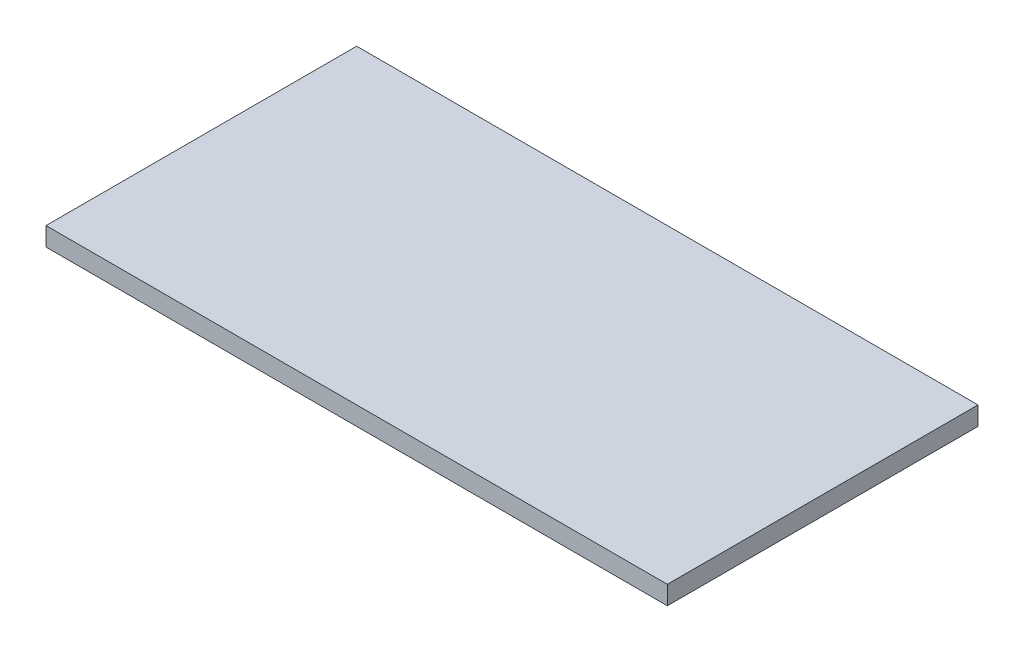
ISO-10303-21;
HEADER;
FILE_DESCRIPTION(('STEP AP214'),'2;1');
FILE_NAME('part.step','',(''),(''),'','','');
FILE_SCHEMA(('AUTOMOTIVE_DESIGN { 1 0 10303 214 1 1 1 1 }'));
ENDSEC;
DATA;
#1=APPLICATION_CONTEXT('core data for automotive mechanical design processes');
#2=APPLICATION_PROTOCOL_DEFINITION('international standard','automotive_design',2000,#1);
#3=PRODUCT_CONTEXT('',#1,'mechanical');
#4=PRODUCT('Part','Part','',(#3));
#5=PRODUCT_RELATED_PRODUCT_CATEGORY('part','',(#4));
#6=PRODUCT_DEFINITION_FORMATION('','',#4);
#7=PRODUCT_DEFINITION_CONTEXT('part definition',#1,'design');
#8=PRODUCT_DEFINITION('design','',#6,#7);
#9=PRODUCT_DEFINITION_SHAPE('','',#8);
#10=(LENGTH_UNIT() NAMED_UNIT(*) SI_UNIT(.MILLI.,.METRE.));
#11=(NAMED_UNIT(*) PLANE_ANGLE_UNIT() SI_UNIT($,.RADIAN.));
#12=(NAMED_UNIT(*) SI_UNIT($,.STERADIAN.) SOLID_ANGLE_UNIT());
#13=UNCERTAINTY_MEASURE_WITH_UNIT(LENGTH_MEASURE(1.E-05),#10,'distance_accuracy_value','');
#14=(GEOMETRIC_REPRESENTATION_CONTEXT(3) GLOBAL_UNCERTAINTY_ASSIGNED_CONTEXT((#13)) GLOBAL_UNIT_ASSIGNED_CONTEXT((#10,
#11,#12)) REPRESENTATION_CONTEXT('',''));
#15=CARTESIAN_POINT('',(0.,0.,0.));
#16=DIRECTION('',(0.,0.,1.));
#17=DIRECTION('',(1.,0.,0.));
#18=AXIS2_PLACEMENT_3D('',#15,#16,#17);
#19=CARTESIAN_POINT('',(12.7,0.762,6.35));
#20=DIRECTION('',(-1.,0.,0.));
#21=DIRECTION('',(0.,0.,1.));
#22=AXIS2_PLACEMENT_3D('',#19,#20,#21);
#23=PLANE('',#22);
#24=DIRECTION('',(0.,0.,-1.));
#25=VECTOR('',#24,1.);
#26=CARTESIAN_POINT('',(12.7,0.,6.35));
#27=LINE('',#26,#25);
#28=CARTESIAN_POINT('',(12.7,0.,6.35));
#29=VERTEX_POINT('',#28);
#30=CARTESIAN_POINT('',(12.7,0.,-6.35));
#31=VERTEX_POINT('',#30);
#32=EDGE_CURVE('E102',#29,#31,#27,.T.);
#33=ORIENTED_EDGE('',*,*,#32,.T.);
#34=DIRECTION('',(0.,-1.,0.));
#35=VECTOR('',#34,1.);
#36=CARTESIAN_POINT('',(12.7,0.762,-6.35));
#37=LINE('',#36,#35);
#38=CARTESIAN_POINT('',(12.7,0.762,-6.35));
#39=VERTEX_POINT('',#38);
#40=EDGE_CURVE('E11',#39,#31,#37,.T.);
#41=ORIENTED_EDGE('',*,*,#40,.F.);
#42=DIRECTION('',(0.,0.,-1.));
#43=VECTOR('',#42,1.);
#44=CARTESIAN_POINT('',(12.7,0.762,6.35));
#45=LINE('',#44,#43);
#46=CARTESIAN_POINT('',(12.7,0.762,6.35));
#47=VERTEX_POINT('',#46);
#48=EDGE_CURVE('E90',#47,#39,#45,.T.);
#49=ORIENTED_EDGE('',*,*,#48,.F.);
#50=DIRECTION('',(0.,-1.,0.));
#51=VECTOR('',#50,1.);
#52=CARTESIAN_POINT('',(12.7,0.762,6.35));
#53=LINE('',#52,#51);
#54=EDGE_CURVE('E98',#47,#29,#53,.T.);
#55=ORIENTED_EDGE('',*,*,#54,.T.);
#56=EDGE_LOOP('',(#33,#41,#49,#55));
#57=FACE_BOUND('',#56,.T.);
#58=ADVANCED_FACE('F39',(#57),#23,.F.);
#59=CARTESIAN_POINT('',(-12.7,0.762,-6.34999999999999));
#60=DIRECTION('',(0.,0.,1.));
#61=DIRECTION('',(1.,0.,0.));
#62=AXIS2_PLACEMENT_3D('',#59,#60,#61);
#63=PLANE('',#62);
#64=DIRECTION('',(-1.,0.,0.));
#65=VECTOR('',#64,1.);
#66=CARTESIAN_POINT('',(-12.7,0.,-6.34999999999999));
#67=LINE('',#66,#65);
#68=CARTESIAN_POINT('',(-12.7,0.,-6.34999999999999));
#69=VERTEX_POINT('',#68);
#70=EDGE_CURVE('E94',#31,#69,#67,.T.);
#71=ORIENTED_EDGE('',*,*,#70,.T.);
#72=DIRECTION('',(0.,-1.,0.));
#73=VECTOR('',#72,1.);
#74=CARTESIAN_POINT('',(-12.7,0.762,-6.34999999999999));
#75=LINE('',#74,#73);
#76=CARTESIAN_POINT('',(-12.7,0.762,-6.34999999999999));
#77=VERTEX_POINT('',#76);
#78=EDGE_CURVE('E47',#77,#69,#75,.T.);
#79=ORIENTED_EDGE('',*,*,#78,.F.);
#80=DIRECTION('',(-1.,0.,0.));
#81=VECTOR('',#80,1.);
#82=CARTESIAN_POINT('',(-12.7,0.762,-6.34999999999999));
#83=LINE('',#82,#81);
#84=EDGE_CURVE('E85',#39,#77,#83,.T.);
#85=ORIENTED_EDGE('',*,*,#84,.F.);
#86=ORIENTED_EDGE('',*,*,#40,.T.);
#87=EDGE_LOOP('',(#71,#79,#85,#86));
#88=FACE_BOUND('',#87,.T.);
#89=ADVANCED_FACE('F93',(#88),#63,.F.);
#90=CARTESIAN_POINT('',(-12.7,0.762,6.35000000000001));
#91=DIRECTION('',(1.,0.,0.));
#92=DIRECTION('',(0.,0.,-1.));
#93=AXIS2_PLACEMENT_3D('',#90,#91,#92);
#94=PLANE('',#93);
#95=DIRECTION('',(0.,0.,1.));
#96=VECTOR('',#95,1.);
#97=CARTESIAN_POINT('',(-12.7,0.,6.35000000000001));
#98=LINE('',#97,#96);
#99=CARTESIAN_POINT('',(-12.7,0.,6.35000000000001));
#100=VERTEX_POINT('',#99);
#101=EDGE_CURVE('E72',#69,#100,#98,.T.);
#102=ORIENTED_EDGE('',*,*,#101,.T.);
#103=DIRECTION('',(0.,-1.,0.));
#104=VECTOR('',#103,1.);
#105=CARTESIAN_POINT('',(-12.7,0.762,6.35000000000001));
#106=LINE('',#105,#104);
#107=CARTESIAN_POINT('',(-12.7,0.762,6.35000000000001));
#108=VERTEX_POINT('',#107);
#109=EDGE_CURVE('E95',#108,#100,#106,.T.);
#110=ORIENTED_EDGE('',*,*,#109,.F.);
#111=DIRECTION('',(0.,0.,1.));
#112=VECTOR('',#111,1.);
#113=CARTESIAN_POINT('',(-12.7,0.762,6.35000000000001));
#114=LINE('',#113,#112);
#115=EDGE_CURVE('E88',#77,#108,#114,.T.);
#116=ORIENTED_EDGE('',*,*,#115,.F.);
#117=ORIENTED_EDGE('',*,*,#78,.T.);
#118=EDGE_LOOP('',(#102,#110,#116,#117));
#119=FACE_BOUND('',#118,.T.);
#120=ADVANCED_FACE('F96',(#119),#94,.F.);
#121=CARTESIAN_POINT('',(-12.7,0.762,6.35000000000001));
#122=DIRECTION('',(0.,0.,-1.));
#123=DIRECTION('',(-1.,0.,0.));
#124=AXIS2_PLACEMENT_3D('',#121,#122,#123);
#125=PLANE('',#124);
#126=DIRECTION('',(1.,0.,0.));
#127=VECTOR('',#126,1.);
#128=CARTESIAN_POINT('',(-12.7,0.,6.35000000000001));
#129=LINE('',#128,#127);
#130=EDGE_CURVE('E78',#100,#29,#129,.T.);
#131=ORIENTED_EDGE('',*,*,#130,.T.);
#132=ORIENTED_EDGE('',*,*,#54,.F.);
#133=DIRECTION('',(1.,0.,0.));
#134=VECTOR('',#133,1.);
#135=CARTESIAN_POINT('',(-12.7,0.762,6.35000000000001));
#136=LINE('',#135,#134);
#137=EDGE_CURVE('E55',#108,#47,#136,.T.);
#138=ORIENTED_EDGE('',*,*,#137,.F.);
#139=ORIENTED_EDGE('',*,*,#109,.T.);
#140=EDGE_LOOP('',(#131,#132,#138,#139));
#141=FACE_BOUND('',#140,.T.);
#142=ADVANCED_FACE('F109',(#141),#125,.F.);
#143=CARTESIAN_POINT('',(0.,0.762,0.));
#144=DIRECTION('',(0.,-1.,0.));
#145=DIRECTION('',(0.,0.,-1.));
#146=AXIS2_PLACEMENT_3D('',#143,#144,#145);
#147=PLANE('',#146);
#148=ORIENTED_EDGE('',*,*,#48,.T.);
#149=ORIENTED_EDGE('',*,*,#84,.T.);
#150=ORIENTED_EDGE('',*,*,#115,.T.);
#151=ORIENTED_EDGE('',*,*,#137,.T.);
#152=EDGE_LOOP('',(#148,#149,#150,#151));
#153=FACE_BOUND('',#152,.T.);
#154=ADVANCED_FACE('F86',(#153),#147,.F.);
#155=CARTESIAN_POINT('',(0.,0.,0.));
#156=DIRECTION('',(0.,-1.,0.));
#157=DIRECTION('',(0.,0.,-1.));
#158=AXIS2_PLACEMENT_3D('',#155,#156,#157);
#159=PLANE('',#158);
#160=ORIENTED_EDGE('',*,*,#32,.F.);
#161=ORIENTED_EDGE('',*,*,#130,.F.);
#162=ORIENTED_EDGE('',*,*,#101,.F.);
#163=ORIENTED_EDGE('',*,*,#70,.F.);
#164=EDGE_LOOP('',(#160,#161,#162,#163));
#165=FACE_BOUND('',#164,.T.);
#166=ADVANCED_FACE('F112',(#165),#159,.T.);
#167=CLOSED_SHELL('',(#58,#89,#120,#142,#154,#166));
#168=MANIFOLD_SOLID_BREP('B2',#167);
#169=ADVANCED_BREP_SHAPE_REPRESENTATION('',(#18,#168),#14);
#170=SHAPE_DEFINITION_REPRESENTATION(#9,#169);
ENDSEC;
END-ISO-10303-21;
